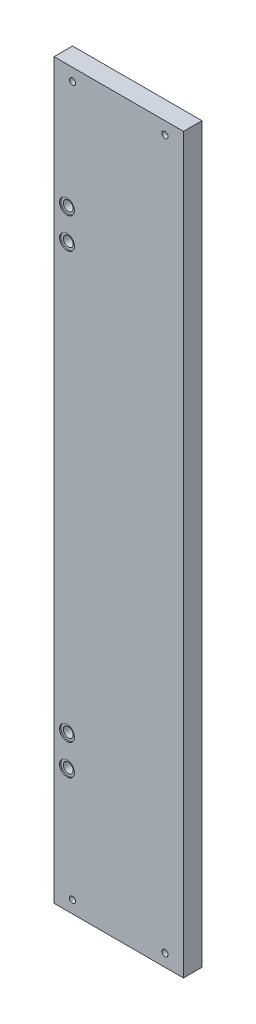
ISO-10303-21;
HEADER;
FILE_DESCRIPTION(('STEP AP214'),'2;1');
FILE_NAME('part.step','',(''),(''),'','','');
FILE_SCHEMA(('AUTOMOTIVE_DESIGN { 1 0 10303 214 1 1 1 1 }'));
ENDSEC;
DATA;
#1=APPLICATION_CONTEXT('core data for automotive mechanical design processes');
#2=APPLICATION_PROTOCOL_DEFINITION('international standard','automotive_design',2000,#1);
#3=PRODUCT_CONTEXT('',#1,'mechanical');
#4=PRODUCT('Part','Part','',(#3));
#5=PRODUCT_RELATED_PRODUCT_CATEGORY('part','',(#4));
#6=PRODUCT_DEFINITION_FORMATION('','',#4);
#7=PRODUCT_DEFINITION_CONTEXT('part definition',#1,'design');
#8=PRODUCT_DEFINITION('design','',#6,#7);
#9=PRODUCT_DEFINITION_SHAPE('','',#8);
#10=(LENGTH_UNIT() NAMED_UNIT(*) SI_UNIT(.MILLI.,.METRE.));
#11=(NAMED_UNIT(*) PLANE_ANGLE_UNIT() SI_UNIT($,.RADIAN.));
#12=(NAMED_UNIT(*) SI_UNIT($,.STERADIAN.) SOLID_ANGLE_UNIT());
#13=UNCERTAINTY_MEASURE_WITH_UNIT(LENGTH_MEASURE(1.E-05),#10,'distance_accuracy_value','');
#14=(GEOMETRIC_REPRESENTATION_CONTEXT(3) GLOBAL_UNCERTAINTY_ASSIGNED_CONTEXT((#13)) GLOBAL_UNIT_ASSIGNED_CONTEXT((#10,
#11,#12)) REPRESENTATION_CONTEXT('',''));
#15=CARTESIAN_POINT('',(0.,0.,0.));
#16=DIRECTION('',(0.,0.,1.));
#17=DIRECTION('',(1.,0.,0.));
#18=AXIS2_PLACEMENT_3D('',#15,#16,#17);
#19=CARTESIAN_POINT('',(-42.,-172.5,0.));
#20=DIRECTION('',(0.,0.,1.));
#21=DIRECTION('',(1.,0.,0.));
#22=AXIS2_PLACEMENT_3D('',#19,#20,#21);
#23=CYLINDRICAL_SURFACE('',#22,3.99999999999999);
#24=CARTESIAN_POINT('',(-42.,-172.5,0.));
#25=DIRECTION('',(0.,0.,-1.));
#26=DIRECTION('',(1.,0.,0.));
#27=AXIS2_PLACEMENT_3D('',#24,#25,#26);
#28=CIRCLE('',#27,3.99999999999999);
#29=CARTESIAN_POINT('',(-38.,-172.5,0.));
#30=VERTEX_POINT('',#29);
#31=EDGE_CURVE('E160',#30,#30,#28,.T.);
#32=ORIENTED_EDGE('',*,*,#31,.T.);
#33=EDGE_LOOP('',(#32));
#34=FACE_BOUND('',#33,.T.);
#35=CARTESIAN_POINT('',(-42.,-172.5,14.));
#36=DIRECTION('',(0.,0.,1.));
#37=DIRECTION('',(1.,0.,0.));
#38=AXIS2_PLACEMENT_3D('',#35,#36,#37);
#39=CIRCLE('',#38,3.99999999999999);
#40=CARTESIAN_POINT('',(-38.,-172.5,14.));
#41=VERTEX_POINT('',#40);
#42=EDGE_CURVE('E41',#41,#41,#39,.T.);
#43=ORIENTED_EDGE('',*,*,#42,.T.);
#44=EDGE_LOOP('',(#43));
#45=FACE_BOUND('',#44,.T.);
#46=ADVANCED_FACE('F37',(#34,#45),#23,.F.);
#47=CARTESIAN_POINT('',(-42.,-197.5,0.));
#48=DIRECTION('',(0.,0.,1.));
#49=DIRECTION('',(1.,0.,0.));
#50=AXIS2_PLACEMENT_3D('',#47,#48,#49);
#51=CYLINDRICAL_SURFACE('',#50,3.99999999999999);
#52=CARTESIAN_POINT('',(-42.,-197.5,0.));
#53=DIRECTION('',(0.,0.,-1.));
#54=DIRECTION('',(1.,0.,0.));
#55=AXIS2_PLACEMENT_3D('',#52,#53,#54);
#56=CIRCLE('',#55,3.99999999999999);
#57=CARTESIAN_POINT('',(-38.,-197.5,0.));
#58=VERTEX_POINT('',#57);
#59=EDGE_CURVE('E163',#58,#58,#56,.T.);
#60=ORIENTED_EDGE('',*,*,#59,.T.);
#61=EDGE_LOOP('',(#60));
#62=FACE_BOUND('',#61,.T.);
#63=CARTESIAN_POINT('',(-42.,-197.5,14.));
#64=DIRECTION('',(0.,0.,1.));
#65=DIRECTION('',(1.,0.,0.));
#66=AXIS2_PLACEMENT_3D('',#63,#64,#65);
#67=CIRCLE('',#66,3.99999999999999);
#68=CARTESIAN_POINT('',(-38.,-197.5,14.));
#69=VERTEX_POINT('',#68);
#70=EDGE_CURVE('E120',#69,#69,#67,.T.);
#71=ORIENTED_EDGE('',*,*,#70,.T.);
#72=EDGE_LOOP('',(#71));
#73=FACE_BOUND('',#72,.T.);
#74=ADVANCED_FACE('F193',(#62,#73),#51,.F.);
#75=CARTESIAN_POINT('',(-42.,172.5,0.));
#76=DIRECTION('',(0.,0.,1.));
#77=DIRECTION('',(1.,0.,0.));
#78=AXIS2_PLACEMENT_3D('',#75,#76,#77);
#79=CYLINDRICAL_SURFACE('',#78,3.99999999999999);
#80=CARTESIAN_POINT('',(-42.,172.5,0.));
#81=DIRECTION('',(0.,0.,1.));
#82=DIRECTION('',(1.,0.,0.));
#83=AXIS2_PLACEMENT_3D('',#80,#81,#82);
#84=CIRCLE('',#83,3.99999999999999);
#85=CARTESIAN_POINT('',(-38.,172.5,0.));
#86=VERTEX_POINT('',#85);
#87=EDGE_CURVE('E178',#86,#86,#84,.T.);
#88=ORIENTED_EDGE('',*,*,#87,.F.);
#89=EDGE_LOOP('',(#88));
#90=FACE_BOUND('',#89,.T.);
#91=CARTESIAN_POINT('',(-42.,172.5,14.));
#92=DIRECTION('',(0.,0.,1.));
#93=DIRECTION('',(1.,0.,0.));
#94=AXIS2_PLACEMENT_3D('',#91,#92,#93);
#95=CIRCLE('',#94,3.99999999999999);
#96=CARTESIAN_POINT('',(-38.,172.5,14.));
#97=VERTEX_POINT('',#96);
#98=EDGE_CURVE('E116',#97,#97,#95,.F.);
#99=ORIENTED_EDGE('',*,*,#98,.F.);
#100=EDGE_LOOP('',(#99));
#101=FACE_BOUND('',#100,.T.);
#102=ADVANCED_FACE('F189',(#90,#101),#79,.F.);
#103=CARTESIAN_POINT('',(-42.,197.5,0.));
#104=DIRECTION('',(0.,0.,1.));
#105=DIRECTION('',(1.,0.,0.));
#106=AXIS2_PLACEMENT_3D('',#103,#104,#105);
#107=CYLINDRICAL_SURFACE('',#106,3.99999999999999);
#108=CARTESIAN_POINT('',(-42.,197.5,0.));
#109=DIRECTION('',(0.,0.,1.));
#110=DIRECTION('',(1.,0.,0.));
#111=AXIS2_PLACEMENT_3D('',#108,#109,#110);
#112=CIRCLE('',#111,3.99999999999999);
#113=CARTESIAN_POINT('',(-38.,197.5,0.));
#114=VERTEX_POINT('',#113);
#115=EDGE_CURVE('E107',#114,#114,#112,.T.);
#116=ORIENTED_EDGE('',*,*,#115,.F.);
#117=EDGE_LOOP('',(#116));
#118=FACE_BOUND('',#117,.T.);
#119=CARTESIAN_POINT('',(-42.,197.5,14.));
#120=DIRECTION('',(0.,0.,1.));
#121=DIRECTION('',(1.,0.,0.));
#122=AXIS2_PLACEMENT_3D('',#119,#120,#121);
#123=CIRCLE('',#122,3.99999999999999);
#124=CARTESIAN_POINT('',(-38.,197.5,14.));
#125=VERTEX_POINT('',#124);
#126=EDGE_CURVE('E113',#125,#125,#123,.F.);
#127=ORIENTED_EDGE('',*,*,#126,.F.);
#128=EDGE_LOOP('',(#127));
#129=FACE_BOUND('',#128,.T.);
#130=ADVANCED_FACE('F192',(#118,#129),#107,.F.);
#131=CARTESIAN_POINT('',(52.5,297.5,15.));
#132=DIRECTION('',(-1.,0.,0.));
#133=DIRECTION('',(0.,-1.,0.));
#134=AXIS2_PLACEMENT_3D('',#131,#132,#133);
#135=PLANE('',#134);
#136=DIRECTION('',(0.,1.,0.));
#137=VECTOR('',#136,1.);
#138=CARTESIAN_POINT('',(52.5,297.5,0.));
#139=LINE('',#138,#137);
#140=CARTESIAN_POINT('',(52.5,-297.5,0.));
#141=VERTEX_POINT('',#140);
#142=CARTESIAN_POINT('',(52.5,297.5,0.));
#143=VERTEX_POINT('',#142);
#144=EDGE_CURVE('E104',#141,#143,#139,.T.);
#145=ORIENTED_EDGE('',*,*,#144,.T.);
#146=DIRECTION('',(0.,0.,-1.));
#147=VECTOR('',#146,1.);
#148=CARTESIAN_POINT('',(52.5,297.5,15.));
#149=LINE('',#148,#147);
#150=CARTESIAN_POINT('',(52.5,297.5,15.));
#151=VERTEX_POINT('',#150);
#152=EDGE_CURVE('E11',#151,#143,#149,.T.);
#153=ORIENTED_EDGE('',*,*,#152,.F.);
#154=DIRECTION('',(0.,1.,0.));
#155=VECTOR('',#154,1.);
#156=CARTESIAN_POINT('',(52.5,297.5,15.));
#157=LINE('',#156,#155);
#158=CARTESIAN_POINT('',(52.5,-297.5,15.));
#159=VERTEX_POINT('',#158);
#160=EDGE_CURVE('E91',#159,#151,#157,.T.);
#161=ORIENTED_EDGE('',*,*,#160,.F.);
#162=DIRECTION('',(0.,0.,-1.));
#163=VECTOR('',#162,1.);
#164=CARTESIAN_POINT('',(52.5,-297.5,15.));
#165=LINE('',#164,#163);
#166=EDGE_CURVE('E100',#159,#141,#165,.T.);
#167=ORIENTED_EDGE('',*,*,#166,.T.);
#168=EDGE_LOOP('',(#145,#153,#161,#167));
#169=FACE_BOUND('',#168,.T.);
#170=ADVANCED_FACE('F39',(#169),#135,.F.);
#171=CARTESIAN_POINT('',(-52.5,297.5,15.));
#172=DIRECTION('',(0.,-1.,0.));
#173=DIRECTION('',(0.,0.,-1.));
#174=AXIS2_PLACEMENT_3D('',#171,#172,#173);
#175=PLANE('',#174);
#176=DIRECTION('',(-1.,0.,0.));
#177=VECTOR('',#176,1.);
#178=CARTESIAN_POINT('',(-52.5,297.5,0.));
#179=LINE('',#178,#177);
#180=CARTESIAN_POINT('',(-52.5,297.5,0.));
#181=VERTEX_POINT('',#180);
#182=EDGE_CURVE('E95',#143,#181,#179,.T.);
#183=ORIENTED_EDGE('',*,*,#182,.T.);
#184=DIRECTION('',(0.,0.,-1.));
#185=VECTOR('',#184,1.);
#186=CARTESIAN_POINT('',(-52.5,297.5,15.));
#187=LINE('',#186,#185);
#188=CARTESIAN_POINT('',(-52.5,297.5,15.));
#189=VERTEX_POINT('',#188);
#190=EDGE_CURVE('E47',#189,#181,#187,.T.);
#191=ORIENTED_EDGE('',*,*,#190,.F.);
#192=DIRECTION('',(-1.,0.,0.));
#193=VECTOR('',#192,1.);
#194=CARTESIAN_POINT('',(-52.5,297.5,15.));
#195=LINE('',#194,#193);
#196=EDGE_CURVE('E86',#151,#189,#195,.T.);
#197=ORIENTED_EDGE('',*,*,#196,.F.);
#198=ORIENTED_EDGE('',*,*,#152,.T.);
#199=EDGE_LOOP('',(#183,#191,#197,#198));
#200=FACE_BOUND('',#199,.T.);
#201=ADVANCED_FACE('F94',(#200),#175,.F.);
#202=CARTESIAN_POINT('',(-52.5,297.5,15.));
#203=DIRECTION('',(1.,0.,0.));
#204=DIRECTION('',(0.,1.,0.));
#205=AXIS2_PLACEMENT_3D('',#202,#203,#204);
#206=PLANE('',#205);
#207=DIRECTION('',(0.,-1.,0.));
#208=VECTOR('',#207,1.);
#209=CARTESIAN_POINT('',(-52.5,297.5,0.));
#210=LINE('',#209,#208);
#211=CARTESIAN_POINT('',(-52.5,-297.5,0.));
#212=VERTEX_POINT('',#211);
#213=EDGE_CURVE('E73',#181,#212,#210,.T.);
#214=ORIENTED_EDGE('',*,*,#213,.T.);
#215=DIRECTION('',(0.,0.,-1.));
#216=VECTOR('',#215,1.);
#217=CARTESIAN_POINT('',(-52.5,-297.5,15.));
#218=LINE('',#217,#216);
#219=CARTESIAN_POINT('',(-52.5,-297.5,15.));
#220=VERTEX_POINT('',#219);
#221=EDGE_CURVE('E96',#220,#212,#218,.T.);
#222=ORIENTED_EDGE('',*,*,#221,.F.);
#223=DIRECTION('',(0.,-1.,0.));
#224=VECTOR('',#223,1.);
#225=CARTESIAN_POINT('',(-52.5,297.5,15.));
#226=LINE('',#225,#224);
#227=EDGE_CURVE('E89',#189,#220,#226,.T.);
#228=ORIENTED_EDGE('',*,*,#227,.F.);
#229=ORIENTED_EDGE('',*,*,#190,.T.);
#230=EDGE_LOOP('',(#214,#222,#228,#229));
#231=FACE_BOUND('',#230,.T.);
#232=ADVANCED_FACE('F98',(#231),#206,.F.);
#233=CARTESIAN_POINT('',(-52.5,-297.5,15.));
#234=DIRECTION('',(0.,1.,0.));
#235=DIRECTION('',(0.,0.,1.));
#236=AXIS2_PLACEMENT_3D('',#233,#234,#235);
#237=PLANE('',#236);
#238=DIRECTION('',(1.,0.,0.));
#239=VECTOR('',#238,1.);
#240=CARTESIAN_POINT('',(-52.5,-297.5,0.));
#241=LINE('',#240,#239);
#242=EDGE_CURVE('E79',#212,#141,#241,.T.);
#243=ORIENTED_EDGE('',*,*,#242,.T.);
#244=ORIENTED_EDGE('',*,*,#166,.F.);
#245=DIRECTION('',(1.,0.,0.));
#246=VECTOR('',#245,1.);
#247=CARTESIAN_POINT('',(-52.5,-297.5,15.));
#248=LINE('',#247,#246);
#249=EDGE_CURVE('E56',#220,#159,#248,.T.);
#250=ORIENTED_EDGE('',*,*,#249,.F.);
#251=ORIENTED_EDGE('',*,*,#221,.T.);
#252=EDGE_LOOP('',(#243,#244,#250,#251));
#253=FACE_BOUND('',#252,.T.);
#254=ADVANCED_FACE('F239',(#253),#237,.F.);
#255=CARTESIAN_POINT('',(0.,0.,15.));
#256=DIRECTION('',(0.,0.,1.));
#257=DIRECTION('',(1.,0.,0.));
#258=AXIS2_PLACEMENT_3D('',#255,#256,#257);
#259=PLANE('',#258);
#260=CARTESIAN_POINT('',(-42.,-197.5,15.));
#261=DIRECTION('',(0.,0.,-1.));
#262=DIRECTION('',(1.,0.,0.));
#263=AXIS2_PLACEMENT_3D('',#260,#261,#262);
#264=CIRCLE('',#263,6.00000000000002);
#265=CARTESIAN_POINT('',(-36.,-197.5,15.));
#266=VERTEX_POINT('',#265);
#267=EDGE_CURVE('E128',#266,#266,#264,.T.);
#268=ORIENTED_EDGE('',*,*,#267,.T.);
#269=EDGE_LOOP('',(#268));
#270=FACE_BOUND('',#269,.T.);
#271=CARTESIAN_POINT('',(-42.,-172.5,15.));
#272=DIRECTION('',(0.,0.,-1.));
#273=DIRECTION('',(1.,0.,0.));
#274=AXIS2_PLACEMENT_3D('',#271,#272,#273);
#275=CIRCLE('',#274,6.00000000000002);
#276=CARTESIAN_POINT('',(-36.,-172.5,15.));
#277=VERTEX_POINT('',#276);
#278=EDGE_CURVE('E138',#277,#277,#275,.T.);
#279=ORIENTED_EDGE('',*,*,#278,.T.);
#280=EDGE_LOOP('',(#279));
#281=FACE_BOUND('',#280,.T.);
#282=CARTESIAN_POINT('',(-42.,197.5,15.));
#283=DIRECTION('',(0.,0.,1.));
#284=DIRECTION('',(1.,0.,0.));
#285=AXIS2_PLACEMENT_3D('',#282,#283,#284);
#286=CIRCLE('',#285,6.00000000000002);
#287=CARTESIAN_POINT('',(-36.,197.5,15.));
#288=VERTEX_POINT('',#287);
#289=EDGE_CURVE('E143',#288,#288,#286,.T.);
#290=ORIENTED_EDGE('',*,*,#289,.F.);
#291=EDGE_LOOP('',(#290));
#292=FACE_BOUND('',#291,.T.);
#293=CARTESIAN_POINT('',(-42.,172.5,15.));
#294=DIRECTION('',(0.,0.,1.));
#295=DIRECTION('',(1.,0.,0.));
#296=AXIS2_PLACEMENT_3D('',#293,#294,#295);
#297=CIRCLE('',#296,6.00000000000002);
#298=CARTESIAN_POINT('',(-36.,172.5,15.));
#299=VERTEX_POINT('',#298);
#300=EDGE_CURVE('E146',#299,#299,#297,.T.);
#301=ORIENTED_EDGE('',*,*,#300,.F.);
#302=EDGE_LOOP('',(#301));
#303=FACE_BOUND('',#302,.T.);
#304=CARTESIAN_POINT('',(37.5,287.5,15.));
#305=DIRECTION('',(0.,0.,-1.));
#306=DIRECTION('',(-1.,0.,0.));
#307=AXIS2_PLACEMENT_3D('',#304,#305,#306);
#308=CIRCLE('',#307,2.5);
#309=CARTESIAN_POINT('',(35.,287.5,15.));
#310=VERTEX_POINT('',#309);
#311=EDGE_CURVE('E119',#310,#310,#308,.T.);
#312=ORIENTED_EDGE('',*,*,#311,.T.);
#313=EDGE_LOOP('',(#312));
#314=FACE_BOUND('',#313,.T.);
#315=CARTESIAN_POINT('',(37.5,-287.5,15.));
#316=DIRECTION('',(0.,0.,1.));
#317=DIRECTION('',(-1.,0.,0.));
#318=AXIS2_PLACEMENT_3D('',#315,#316,#317);
#319=CIRCLE('',#318,2.5);
#320=CARTESIAN_POINT('',(35.,-287.5,15.));
#321=VERTEX_POINT('',#320);
#322=EDGE_CURVE('E154',#321,#321,#319,.T.);
#323=ORIENTED_EDGE('',*,*,#322,.F.);
#324=EDGE_LOOP('',(#323));
#325=FACE_BOUND('',#324,.T.);
#326=CARTESIAN_POINT('',(-37.5,-287.5,15.));
#327=DIRECTION('',(0.,0.,-1.));
#328=DIRECTION('',(1.,0.,0.));
#329=AXIS2_PLACEMENT_3D('',#326,#327,#328);
#330=CIRCLE('',#329,2.5);
#331=CARTESIAN_POINT('',(-35.,-287.5,15.));
#332=VERTEX_POINT('',#331);
#333=EDGE_CURVE('E166',#332,#332,#330,.T.);
#334=ORIENTED_EDGE('',*,*,#333,.T.);
#335=EDGE_LOOP('',(#334));
#336=FACE_BOUND('',#335,.T.);
#337=CARTESIAN_POINT('',(-37.5,287.5,15.));
#338=DIRECTION('',(0.,0.,1.));
#339=DIRECTION('',(1.,0.,0.));
#340=AXIS2_PLACEMENT_3D('',#337,#338,#339);
#341=CIRCLE('',#340,2.5);
#342=CARTESIAN_POINT('',(-35.,287.5,15.));
#343=VERTEX_POINT('',#342);
#344=EDGE_CURVE('E172',#343,#343,#341,.T.);
#345=ORIENTED_EDGE('',*,*,#344,.F.);
#346=EDGE_LOOP('',(#345));
#347=FACE_BOUND('',#346,.T.);
#348=ORIENTED_EDGE('',*,*,#160,.T.);
#349=ORIENTED_EDGE('',*,*,#196,.T.);
#350=ORIENTED_EDGE('',*,*,#227,.T.);
#351=ORIENTED_EDGE('',*,*,#249,.T.);
#352=EDGE_LOOP('',(#348,#349,#350,#351));
#353=FACE_BOUND('',#352,.T.);
#354=ADVANCED_FACE('F87',(#270,#281,#292,#303,#314,#325,#336,#347,#353),#259,.T.);
#355=CARTESIAN_POINT('',(0.,0.,0.));
#356=DIRECTION('',(0.,0.,1.));
#357=DIRECTION('',(1.,0.,0.));
#358=AXIS2_PLACEMENT_3D('',#355,#356,#357);
#359=PLANE('',#358);
#360=CARTESIAN_POINT('',(37.5,287.5,0.));
#361=DIRECTION('',(0.,0.,-1.));
#362=DIRECTION('',(-1.,0.,0.));
#363=AXIS2_PLACEMENT_3D('',#360,#361,#362);
#364=CIRCLE('',#363,2.5);
#365=CARTESIAN_POINT('',(35.,287.5,0.));
#366=VERTEX_POINT('',#365);
#367=EDGE_CURVE('E151',#366,#366,#364,.T.);
#368=ORIENTED_EDGE('',*,*,#367,.F.);
#369=EDGE_LOOP('',(#368));
#370=FACE_BOUND('',#369,.T.);
#371=CARTESIAN_POINT('',(37.5,-287.5,0.));
#372=DIRECTION('',(0.,0.,1.));
#373=DIRECTION('',(-1.,0.,0.));
#374=AXIS2_PLACEMENT_3D('',#371,#372,#373);
#375=CIRCLE('',#374,2.5);
#376=CARTESIAN_POINT('',(35.,-287.5,0.));
#377=VERTEX_POINT('',#376);
#378=EDGE_CURVE('E157',#377,#377,#375,.T.);
#379=ORIENTED_EDGE('',*,*,#378,.T.);
#380=EDGE_LOOP('',(#379));
#381=FACE_BOUND('',#380,.T.);
#382=ORIENTED_EDGE('',*,*,#59,.F.);
#383=EDGE_LOOP('',(#382));
#384=FACE_BOUND('',#383,.T.);
#385=ORIENTED_EDGE('',*,*,#31,.F.);
#386=EDGE_LOOP('',(#385));
#387=FACE_BOUND('',#386,.T.);
#388=CARTESIAN_POINT('',(-37.5,-287.5,0.));
#389=DIRECTION('',(0.,0.,-1.));
#390=DIRECTION('',(1.,0.,0.));
#391=AXIS2_PLACEMENT_3D('',#388,#389,#390);
#392=CIRCLE('',#391,2.5);
#393=CARTESIAN_POINT('',(-35.,-287.5,0.));
#394=VERTEX_POINT('',#393);
#395=EDGE_CURVE('E169',#394,#394,#392,.T.);
#396=ORIENTED_EDGE('',*,*,#395,.F.);
#397=EDGE_LOOP('',(#396));
#398=FACE_BOUND('',#397,.T.);
#399=CARTESIAN_POINT('',(-37.5,287.5,0.));
#400=DIRECTION('',(0.,0.,1.));
#401=DIRECTION('',(1.,0.,0.));
#402=AXIS2_PLACEMENT_3D('',#399,#400,#401);
#403=CIRCLE('',#402,2.5);
#404=CARTESIAN_POINT('',(-35.,287.5,0.));
#405=VERTEX_POINT('',#404);
#406=EDGE_CURVE('E175',#405,#405,#403,.T.);
#407=ORIENTED_EDGE('',*,*,#406,.T.);
#408=EDGE_LOOP('',(#407));
#409=FACE_BOUND('',#408,.T.);
#410=ORIENTED_EDGE('',*,*,#115,.T.);
#411=EDGE_LOOP('',(#410));
#412=FACE_BOUND('',#411,.T.);
#413=ORIENTED_EDGE('',*,*,#87,.T.);
#414=EDGE_LOOP('',(#413));
#415=FACE_BOUND('',#414,.T.);
#416=ORIENTED_EDGE('',*,*,#144,.F.);
#417=ORIENTED_EDGE('',*,*,#242,.F.);
#418=ORIENTED_EDGE('',*,*,#213,.F.);
#419=ORIENTED_EDGE('',*,*,#182,.F.);
#420=EDGE_LOOP('',(#416,#417,#418,#419));
#421=FACE_BOUND('',#420,.T.);
#422=ADVANCED_FACE('F186',(#370,#381,#384,#387,#398,#409,#412,#415,#421),#359,.F.);
#423=CARTESIAN_POINT('',(-37.5,287.5,0.));
#424=DIRECTION('',(0.,0.,1.));
#425=DIRECTION('',(1.,0.,0.));
#426=AXIS2_PLACEMENT_3D('',#423,#424,#425);
#427=CYLINDRICAL_SURFACE('',#426,2.5);
#428=ORIENTED_EDGE('',*,*,#406,.F.);
#429=EDGE_LOOP('',(#428));
#430=FACE_BOUND('',#429,.T.);
#431=ORIENTED_EDGE('',*,*,#344,.T.);
#432=EDGE_LOOP('',(#431));
#433=FACE_BOUND('',#432,.T.);
#434=ADVANCED_FACE('F229',(#430,#433),#427,.F.);
#435=CARTESIAN_POINT('',(-37.5,-287.5,0.));
#436=DIRECTION('',(0.,0.,1.));
#437=DIRECTION('',(1.,0.,0.));
#438=AXIS2_PLACEMENT_3D('',#435,#436,#437);
#439=CYLINDRICAL_SURFACE('',#438,2.5);
#440=ORIENTED_EDGE('',*,*,#395,.T.);
#441=EDGE_LOOP('',(#440));
#442=FACE_BOUND('',#441,.T.);
#443=ORIENTED_EDGE('',*,*,#333,.F.);
#444=EDGE_LOOP('',(#443));
#445=FACE_BOUND('',#444,.T.);
#446=ADVANCED_FACE('F225',(#442,#445),#439,.F.);
#447=CARTESIAN_POINT('',(37.5,-287.5,0.));
#448=DIRECTION('',(0.,0.,1.));
#449=DIRECTION('',(1.,0.,0.));
#450=AXIS2_PLACEMENT_3D('',#447,#448,#449);
#451=CYLINDRICAL_SURFACE('',#450,2.5);
#452=ORIENTED_EDGE('',*,*,#378,.F.);
#453=EDGE_LOOP('',(#452));
#454=FACE_BOUND('',#453,.T.);
#455=ORIENTED_EDGE('',*,*,#322,.T.);
#456=EDGE_LOOP('',(#455));
#457=FACE_BOUND('',#456,.T.);
#458=ADVANCED_FACE('F228',(#454,#457),#451,.F.);
#459=CARTESIAN_POINT('',(37.5,287.5,0.));
#460=DIRECTION('',(0.,0.,1.));
#461=DIRECTION('',(1.,0.,0.));
#462=AXIS2_PLACEMENT_3D('',#459,#460,#461);
#463=CYLINDRICAL_SURFACE('',#462,2.5);
#464=ORIENTED_EDGE('',*,*,#367,.T.);
#465=EDGE_LOOP('',(#464));
#466=FACE_BOUND('',#465,.T.);
#467=ORIENTED_EDGE('',*,*,#311,.F.);
#468=EDGE_LOOP('',(#467));
#469=FACE_BOUND('',#468,.T.);
#470=ADVANCED_FACE('F362',(#466,#469),#463,.F.);
#471=CARTESIAN_POINT('',(-42.,197.5,14.));
#472=DIRECTION('',(0.,0.,1.));
#473=DIRECTION('',(1.,0.,0.));
#474=AXIS2_PLACEMENT_3D('',#471,#472,#473);
#475=PLANE('',#474);
#476=CARTESIAN_POINT('',(-42.,197.5,14.));
#477=DIRECTION('',(0.,0.,1.));
#478=DIRECTION('',(1.,0.,0.));
#479=AXIS2_PLACEMENT_3D('',#476,#477,#478);
#480=CIRCLE('',#479,6.00000000000002);
#481=CARTESIAN_POINT('',(-36.,197.5,14.));
#482=VERTEX_POINT('',#481);
#483=EDGE_CURVE('E117',#482,#482,#480,.T.);
#484=ORIENTED_EDGE('',*,*,#483,.T.);
#485=EDGE_LOOP('',(#484));
#486=FACE_BOUND('',#485,.T.);
#487=ORIENTED_EDGE('',*,*,#126,.T.);
#488=EDGE_LOOP('',(#487));
#489=FACE_BOUND('',#488,.T.);
#490=ADVANCED_FACE('F210',(#486,#489),#475,.T.);
#491=CARTESIAN_POINT('',(-42.,197.5,14.));
#492=DIRECTION('',(0.,0.,1.));
#493=DIRECTION('',(1.,0.,0.));
#494=AXIS2_PLACEMENT_3D('',#491,#492,#493);
#495=CYLINDRICAL_SURFACE('',#494,6.00000000000002);
#496=ORIENTED_EDGE('',*,*,#483,.F.);
#497=EDGE_LOOP('',(#496));
#498=FACE_BOUND('',#497,.T.);
#499=ORIENTED_EDGE('',*,*,#289,.T.);
#500=EDGE_LOOP('',(#499));
#501=FACE_BOUND('',#500,.T.);
#502=ADVANCED_FACE('F200',(#498,#501),#495,.F.);
#503=CARTESIAN_POINT('',(-42.,172.5,14.));
#504=DIRECTION('',(0.,0.,1.));
#505=DIRECTION('',(1.,0.,0.));
#506=AXIS2_PLACEMENT_3D('',#503,#504,#505);
#507=PLANE('',#506);
#508=CARTESIAN_POINT('',(-42.,172.5,14.));
#509=DIRECTION('',(0.,0.,1.));
#510=DIRECTION('',(1.,0.,0.));
#511=AXIS2_PLACEMENT_3D('',#508,#509,#510);
#512=CIRCLE('',#511,6.00000000000002);
#513=CARTESIAN_POINT('',(-36.,172.5,14.));
#514=VERTEX_POINT('',#513);
#515=EDGE_CURVE('E126',#514,#514,#512,.T.);
#516=ORIENTED_EDGE('',*,*,#515,.T.);
#517=EDGE_LOOP('',(#516));
#518=FACE_BOUND('',#517,.T.);
#519=ORIENTED_EDGE('',*,*,#98,.T.);
#520=EDGE_LOOP('',(#519));
#521=FACE_BOUND('',#520,.T.);
#522=ADVANCED_FACE('F197',(#518,#521),#507,.T.);
#523=CARTESIAN_POINT('',(-42.,172.5,14.));
#524=DIRECTION('',(0.,0.,1.));
#525=DIRECTION('',(1.,0.,0.));
#526=AXIS2_PLACEMENT_3D('',#523,#524,#525);
#527=CYLINDRICAL_SURFACE('',#526,6.00000000000002);
#528=ORIENTED_EDGE('',*,*,#515,.F.);
#529=EDGE_LOOP('',(#528));
#530=FACE_BOUND('',#529,.T.);
#531=ORIENTED_EDGE('',*,*,#300,.T.);
#532=EDGE_LOOP('',(#531));
#533=FACE_BOUND('',#532,.T.);
#534=ADVANCED_FACE('F199',(#530,#533),#527,.F.);
#535=CARTESIAN_POINT('',(-42.,-197.5,14.));
#536=DIRECTION('',(0.,0.,1.));
#537=DIRECTION('',(1.,0.,0.));
#538=AXIS2_PLACEMENT_3D('',#535,#536,#537);
#539=CYLINDRICAL_SURFACE('',#538,6.00000000000002);
#540=CARTESIAN_POINT('',(-42.,-197.5,14.));
#541=DIRECTION('',(0.,0.,-1.));
#542=DIRECTION('',(1.,0.,0.));
#543=AXIS2_PLACEMENT_3D('',#540,#541,#542);
#544=CIRCLE('',#543,6.00000000000002);
#545=CARTESIAN_POINT('',(-36.,-197.5,14.));
#546=VERTEX_POINT('',#545);
#547=EDGE_CURVE('E122',#546,#546,#544,.T.);
#548=ORIENTED_EDGE('',*,*,#547,.T.);
#549=EDGE_LOOP('',(#548));
#550=FACE_BOUND('',#549,.T.);
#551=ORIENTED_EDGE('',*,*,#267,.F.);
#552=EDGE_LOOP('',(#551));
#553=FACE_BOUND('',#552,.T.);
#554=ADVANCED_FACE('F207',(#550,#553),#539,.F.);
#555=CARTESIAN_POINT('',(-42.,-197.5,14.));
#556=DIRECTION('',(0.,0.,1.));
#557=DIRECTION('',(1.,0.,0.));
#558=AXIS2_PLACEMENT_3D('',#555,#556,#557);
#559=PLANE('',#558);
#560=ORIENTED_EDGE('',*,*,#70,.F.);
#561=EDGE_LOOP('',(#560));
#562=FACE_BOUND('',#561,.T.);
#563=ORIENTED_EDGE('',*,*,#547,.F.);
#564=EDGE_LOOP('',(#563));
#565=FACE_BOUND('',#564,.T.);
#566=ADVANCED_FACE('F291',(#562,#565),#559,.T.);
#567=CARTESIAN_POINT('',(-42.,-172.5,14.));
#568=DIRECTION('',(0.,0.,1.));
#569=DIRECTION('',(1.,0.,0.));
#570=AXIS2_PLACEMENT_3D('',#567,#568,#569);
#571=CYLINDRICAL_SURFACE('',#570,6.00000000000002);
#572=CARTESIAN_POINT('',(-42.,-172.5,14.));
#573=DIRECTION('',(0.,0.,-1.));
#574=DIRECTION('',(1.,0.,0.));
#575=AXIS2_PLACEMENT_3D('',#572,#573,#574);
#576=CIRCLE('',#575,6.00000000000002);
#577=CARTESIAN_POINT('',(-36.,-172.5,14.));
#578=VERTEX_POINT('',#577);
#579=EDGE_CURVE('E133',#578,#578,#576,.T.);
#580=ORIENTED_EDGE('',*,*,#579,.T.);
#581=EDGE_LOOP('',(#580));
#582=FACE_BOUND('',#581,.T.);
#583=ORIENTED_EDGE('',*,*,#278,.F.);
#584=EDGE_LOOP('',(#583));
#585=FACE_BOUND('',#584,.T.);
#586=ADVANCED_FACE('F302',(#582,#585),#571,.F.);
#587=CARTESIAN_POINT('',(-42.,-172.5,14.));
#588=DIRECTION('',(0.,0.,1.));
#589=DIRECTION('',(1.,0.,0.));
#590=AXIS2_PLACEMENT_3D('',#587,#588,#589);
#591=PLANE('',#590);
#592=ORIENTED_EDGE('',*,*,#42,.F.);
#593=EDGE_LOOP('',(#592));
#594=FACE_BOUND('',#593,.T.);
#595=ORIENTED_EDGE('',*,*,#579,.F.);
#596=EDGE_LOOP('',(#595));
#597=FACE_BOUND('',#596,.T.);
#598=ADVANCED_FACE('F313',(#594,#597),#591,.T.);
#599=CLOSED_SHELL('',(#46,#74,#102,#130,#170,#201,#232,#254,#354,#422,#434,#446,#458,#470,#490,
#502,#522,#534,#554,#566,#586,#598));
#600=MANIFOLD_SOLID_BREP('B2',#599);
#601=ADVANCED_BREP_SHAPE_REPRESENTATION('',(#18,#600),#14);
#602=SHAPE_DEFINITION_REPRESENTATION(#9,#601);
ENDSEC;
END-ISO-10303-21;
